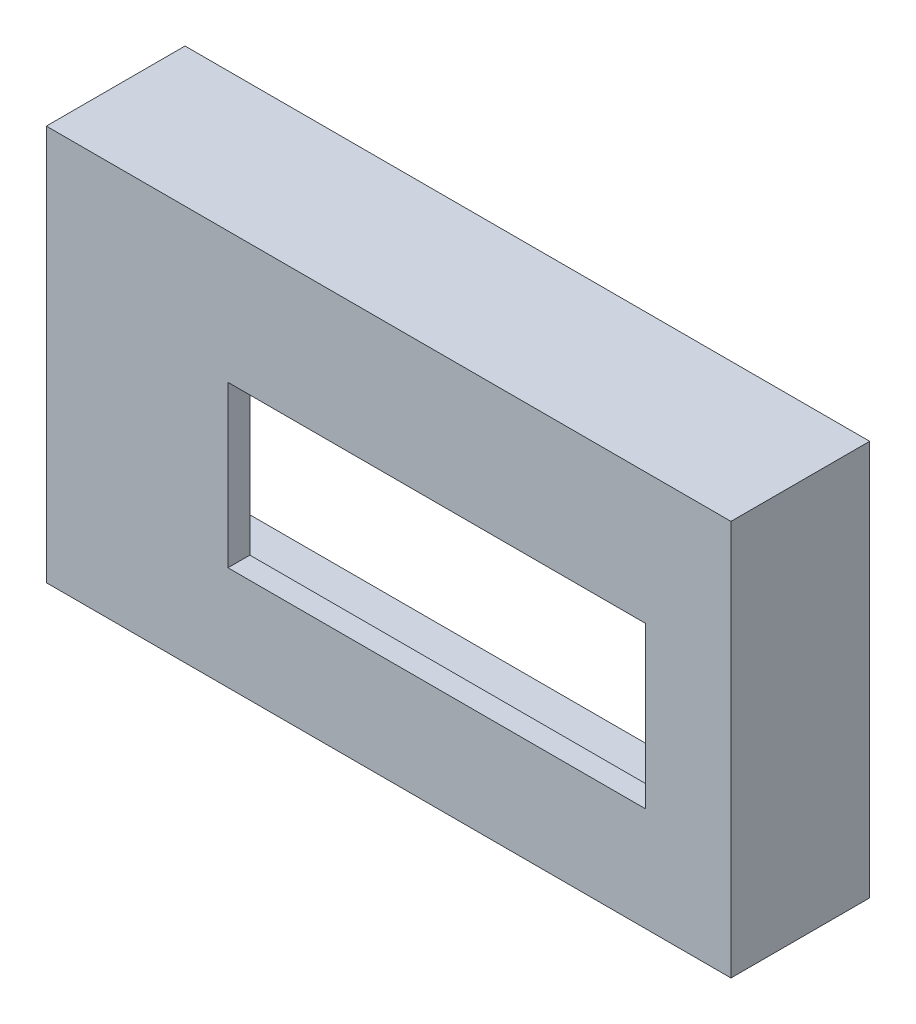
ISO-10303-21;
HEADER;
FILE_DESCRIPTION(('STEP AP214'),'2;1');
FILE_NAME('part.step','',(''),(''),'','','');
FILE_SCHEMA(('AUTOMOTIVE_DESIGN { 1 0 10303 214 1 1 1 1 }'));
ENDSEC;
DATA;
#1=APPLICATION_CONTEXT('core data for automotive mechanical design processes');
#2=APPLICATION_PROTOCOL_DEFINITION('international standard','automotive_design',2000,#1);
#3=PRODUCT_CONTEXT('',#1,'mechanical');
#4=PRODUCT('Part','Part','',(#3));
#5=PRODUCT_RELATED_PRODUCT_CATEGORY('part','',(#4));
#6=PRODUCT_DEFINITION_FORMATION('','',#4);
#7=PRODUCT_DEFINITION_CONTEXT('part definition',#1,'design');
#8=PRODUCT_DEFINITION('design','',#6,#7);
#9=PRODUCT_DEFINITION_SHAPE('','',#8);
#10=(LENGTH_UNIT() NAMED_UNIT(*) SI_UNIT(.MILLI.,.METRE.));
#11=(NAMED_UNIT(*) PLANE_ANGLE_UNIT() SI_UNIT($,.RADIAN.));
#12=(NAMED_UNIT(*) SI_UNIT($,.STERADIAN.) SOLID_ANGLE_UNIT());
#13=UNCERTAINTY_MEASURE_WITH_UNIT(LENGTH_MEASURE(1.E-05),#10,'distance_accuracy_value','');
#14=(GEOMETRIC_REPRESENTATION_CONTEXT(3) GLOBAL_UNCERTAINTY_ASSIGNED_CONTEXT((#13)) GLOBAL_UNIT_ASSIGNED_CONTEXT((#10,
#11,#12)) REPRESENTATION_CONTEXT('',''));
#15=CARTESIAN_POINT('',(0.,0.,0.));
#16=DIRECTION('',(0.,0.,1.));
#17=DIRECTION('',(1.,0.,0.));
#18=AXIS2_PLACEMENT_3D('',#15,#16,#17);
#19=CARTESIAN_POINT('',(0.,0.,0.));
#20=DIRECTION('',(0.,0.,1.));
#21=DIRECTION('',(1.,0.,0.));
#22=AXIS2_PLACEMENT_3D('',#19,#20,#21);
#23=PLANE('',#22);
#24=DIRECTION('',(-1.,0.,0.));
#25=VECTOR('',#24,1.);
#26=CARTESIAN_POINT('',(76.708,31.496,0.));
#27=LINE('',#26,#25);
#28=CARTESIAN_POINT('',(76.708,31.496,0.));
#29=VERTEX_POINT('',#28);
#30=CARTESIAN_POINT('',(4.064,31.496,0.));
#31=VERTEX_POINT('',#30);
#32=EDGE_CURVE('E171',#29,#31,#27,.T.);
#33=ORIENTED_EDGE('',*,*,#32,.T.);
#34=DIRECTION('',(0.,-1.,0.));
#35=VECTOR('',#34,1.);
#36=CARTESIAN_POINT('',(4.064,31.496,0.));
#37=LINE('',#36,#35);
#38=CARTESIAN_POINT('',(4.064,3.556,0.));
#39=VERTEX_POINT('',#38);
#40=EDGE_CURVE('E185',#31,#39,#37,.T.);
#41=ORIENTED_EDGE('',*,*,#40,.T.);
#42=DIRECTION('',(1.,0.,0.));
#43=VECTOR('',#42,1.);
#44=CARTESIAN_POINT('',(4.064,3.556,0.));
#45=LINE('',#44,#43);
#46=CARTESIAN_POINT('',(76.708,3.556,0.));
#47=VERTEX_POINT('',#46);
#48=EDGE_CURVE('E188',#39,#47,#45,.T.);
#49=ORIENTED_EDGE('',*,*,#48,.T.);
#50=DIRECTION('',(0.,1.,0.));
#51=VECTOR('',#50,1.);
#52=CARTESIAN_POINT('',(76.708,3.556,0.));
#53=LINE('',#52,#51);
#54=EDGE_CURVE('E175',#47,#29,#53,.T.);
#55=ORIENTED_EDGE('',*,*,#54,.T.);
#56=EDGE_LOOP('',(#33,#41,#49,#55));
#57=FACE_BOUND('',#56,.T.);
#58=DIRECTION('',(-1.,0.,0.));
#59=VECTOR('',#58,1.);
#60=CARTESIAN_POINT('',(-23.7229749034747,50.4908432830178,0.));
#61=LINE('',#60,#59);
#62=CARTESIAN_POINT('',(87.7620343020093,50.4908432830178,0.));
#63=VERTEX_POINT('',#62);
#64=CARTESIAN_POINT('',(-23.7229749034747,50.4908432830178,0.));
#65=VERTEX_POINT('',#64);
#66=EDGE_CURVE('E48',#63,#65,#61,.T.);
#67=ORIENTED_EDGE('',*,*,#66,.F.);
#68=DIRECTION('',(0.,1.,0.));
#69=VECTOR('',#68,1.);
#70=CARTESIAN_POINT('',(87.7620343020093,50.4908432830178,0.));
#71=LINE('',#70,#69);
#72=CARTESIAN_POINT('',(87.7620343020093,-10.6856321834333,0.));
#73=VERTEX_POINT('',#72);
#74=EDGE_CURVE('E53',#73,#63,#71,.T.);
#75=ORIENTED_EDGE('',*,*,#74,.F.);
#76=DIRECTION('',(1.,0.,0.));
#77=VECTOR('',#76,1.);
#78=CARTESIAN_POINT('',(-23.7229749034747,-10.6856321834333,0.));
#79=LINE('',#78,#77);
#80=CARTESIAN_POINT('',(-23.7229749034747,-10.6856321834333,0.));
#81=VERTEX_POINT('',#80);
#82=EDGE_CURVE('E144',#81,#73,#79,.T.);
#83=ORIENTED_EDGE('',*,*,#82,.F.);
#84=DIRECTION('',(0.,-1.,0.));
#85=VECTOR('',#84,1.);
#86=CARTESIAN_POINT('',(-23.7229749034747,50.4908432830178,0.));
#87=LINE('',#86,#85);
#88=EDGE_CURVE('E150',#65,#81,#87,.T.);
#89=ORIENTED_EDGE('',*,*,#88,.F.);
#90=EDGE_LOOP('',(#67,#75,#83,#89));
#91=FACE_BOUND('',#90,.T.);
#92=ADVANCED_FACE('F33',(#57,#91),#23,.F.);
#93=CARTESIAN_POINT('',(0.,0.,3.81));
#94=DIRECTION('',(0.,0.,1.));
#95=DIRECTION('',(1.,0.,0.));
#96=AXIS2_PLACEMENT_3D('',#93,#94,#95);
#97=PLANE('',#96);
#98=DIRECTION('',(0.,1.,0.));
#99=VECTOR('',#98,1.);
#100=CARTESIAN_POINT('',(91.5720343020093,-14.4956321834333,3.81));
#101=LINE('',#100,#99);
#102=CARTESIAN_POINT('',(91.5720343020093,-14.4956321834333,3.81));
#103=VERTEX_POINT('',#102);
#104=CARTESIAN_POINT('',(91.5720343020093,54.3008432830178,3.81));
#105=VERTEX_POINT('',#104);
#106=EDGE_CURVE('E202',#103,#105,#101,.T.);
#107=ORIENTED_EDGE('',*,*,#106,.T.);
#108=DIRECTION('',(-1.,0.,0.));
#109=VECTOR('',#108,1.);
#110=CARTESIAN_POINT('',(91.5720343020093,54.3008432830178,3.81));
#111=LINE('',#110,#109);
#112=CARTESIAN_POINT('',(-27.5329749034747,54.3008432830178,3.81));
#113=VERTEX_POINT('',#112);
#114=EDGE_CURVE('E205',#105,#113,#111,.T.);
#115=ORIENTED_EDGE('',*,*,#114,.T.);
#116=DIRECTION('',(0.,-1.,0.));
#117=VECTOR('',#116,1.);
#118=CARTESIAN_POINT('',(-27.5329749034747,-14.4956321834333,3.81));
#119=LINE('',#118,#117);
#120=CARTESIAN_POINT('',(-27.5329749034747,-14.4956321834333,3.81));
#121=VERTEX_POINT('',#120);
#122=EDGE_CURVE('E207',#113,#121,#119,.T.);
#123=ORIENTED_EDGE('',*,*,#122,.T.);
#124=DIRECTION('',(1.,0.,0.));
#125=VECTOR('',#124,1.);
#126=CARTESIAN_POINT('',(91.5720343020093,-14.4956321834333,3.81));
#127=LINE('',#126,#125);
#128=EDGE_CURVE('E209',#121,#103,#127,.T.);
#129=ORIENTED_EDGE('',*,*,#128,.T.);
#130=EDGE_LOOP('',(#107,#115,#123,#129));
#131=FACE_BOUND('',#130,.T.);
#132=DIRECTION('',(0.,-1.,0.));
#133=VECTOR('',#132,1.);
#134=CARTESIAN_POINT('',(4.064,31.496,3.81));
#135=LINE('',#134,#133);
#136=CARTESIAN_POINT('',(4.064,31.496,3.81));
#137=VERTEX_POINT('',#136);
#138=CARTESIAN_POINT('',(4.064,3.556,3.81));
#139=VERTEX_POINT('',#138);
#140=EDGE_CURVE('E174',#137,#139,#135,.T.);
#141=ORIENTED_EDGE('',*,*,#140,.F.);
#142=DIRECTION('',(-1.,0.,0.));
#143=VECTOR('',#142,1.);
#144=CARTESIAN_POINT('',(76.708,31.496,3.81));
#145=LINE('',#144,#143);
#146=CARTESIAN_POINT('',(76.708,31.496,3.81));
#147=VERTEX_POINT('',#146);
#148=EDGE_CURVE('E172',#147,#137,#145,.T.);
#149=ORIENTED_EDGE('',*,*,#148,.F.);
#150=DIRECTION('',(0.,1.,0.));
#151=VECTOR('',#150,1.);
#152=CARTESIAN_POINT('',(76.708,3.556,3.81));
#153=LINE('',#152,#151);
#154=CARTESIAN_POINT('',(76.708,3.556,3.81));
#155=VERTEX_POINT('',#154);
#156=EDGE_CURVE('E180',#155,#147,#153,.T.);
#157=ORIENTED_EDGE('',*,*,#156,.F.);
#158=DIRECTION('',(1.,0.,0.));
#159=VECTOR('',#158,1.);
#160=CARTESIAN_POINT('',(4.064,3.556,3.81));
#161=LINE('',#160,#159);
#162=EDGE_CURVE('E177',#139,#155,#161,.T.);
#163=ORIENTED_EDGE('',*,*,#162,.F.);
#164=EDGE_LOOP('',(#141,#149,#157,#163));
#165=FACE_BOUND('',#164,.T.);
#166=ADVANCED_FACE('F233',(#131,#165),#97,.T.);
#167=CARTESIAN_POINT('',(91.5720343020093,-14.4956321834333,3.81));
#168=DIRECTION('',(-1.,0.,0.));
#169=DIRECTION('',(0.,0.,1.));
#170=AXIS2_PLACEMENT_3D('',#167,#168,#169);
#171=PLANE('',#170);
#172=DIRECTION('',(0.,0.,-1.));
#173=VECTOR('',#172,1.);
#174=CARTESIAN_POINT('',(91.5720343020093,-14.4956321834333,3.81));
#175=LINE('',#174,#173);
#176=CARTESIAN_POINT('',(91.5720343020093,-14.4956321834333,-20.32));
#177=VERTEX_POINT('',#176);
#178=EDGE_CURVE('E211',#103,#177,#175,.T.);
#179=ORIENTED_EDGE('',*,*,#178,.T.);
#180=DIRECTION('',(0.,1.,0.));
#181=VECTOR('',#180,1.);
#182=CARTESIAN_POINT('',(91.5720343020093,54.3008432830178,-20.32));
#183=LINE('',#182,#181);
#184=CARTESIAN_POINT('',(91.5720343020093,54.3008432830178,-20.32));
#185=VERTEX_POINT('',#184);
#186=EDGE_CURVE('E165',#177,#185,#183,.T.);
#187=ORIENTED_EDGE('',*,*,#186,.T.);
#188=DIRECTION('',(0.,0.,-1.));
#189=VECTOR('',#188,1.);
#190=CARTESIAN_POINT('',(91.5720343020093,54.3008432830178,3.81));
#191=LINE('',#190,#189);
#192=EDGE_CURVE('E11',#105,#185,#191,.T.);
#193=ORIENTED_EDGE('',*,*,#192,.F.);
#194=ORIENTED_EDGE('',*,*,#106,.F.);
#195=EDGE_LOOP('',(#179,#187,#193,#194));
#196=FACE_BOUND('',#195,.T.);
#197=ADVANCED_FACE('F35',(#196),#171,.F.);
#198=CARTESIAN_POINT('',(91.5720343020093,54.3008432830178,3.81));
#199=DIRECTION('',(0.,-1.,0.));
#200=DIRECTION('',(0.,0.,-1.));
#201=AXIS2_PLACEMENT_3D('',#198,#199,#200);
#202=PLANE('',#201);
#203=ORIENTED_EDGE('',*,*,#192,.T.);
#204=DIRECTION('',(-1.,0.,0.));
#205=VECTOR('',#204,1.);
#206=CARTESIAN_POINT('',(-27.5329749034747,54.3008432830178,-20.32));
#207=LINE('',#206,#205);
#208=CARTESIAN_POINT('',(-27.5329749034747,54.3008432830178,-20.32));
#209=VERTEX_POINT('',#208);
#210=EDGE_CURVE('E168',#185,#209,#207,.T.);
#211=ORIENTED_EDGE('',*,*,#210,.T.);
#212=DIRECTION('',(0.,0.,-1.));
#213=VECTOR('',#212,1.);
#214=CARTESIAN_POINT('',(-27.5329749034747,54.3008432830178,3.81));
#215=LINE('',#214,#213);
#216=EDGE_CURVE('E41',#113,#209,#215,.T.);
#217=ORIENTED_EDGE('',*,*,#216,.F.);
#218=ORIENTED_EDGE('',*,*,#114,.F.);
#219=EDGE_LOOP('',(#203,#211,#217,#218));
#220=FACE_BOUND('',#219,.T.);
#221=ADVANCED_FACE('F224',(#220),#202,.F.);
#222=CARTESIAN_POINT('',(-27.5329749034747,-14.4956321834333,3.81));
#223=DIRECTION('',(1.,0.,0.));
#224=DIRECTION('',(0.,0.,-1.));
#225=AXIS2_PLACEMENT_3D('',#222,#223,#224);
#226=PLANE('',#225);
#227=ORIENTED_EDGE('',*,*,#216,.T.);
#228=DIRECTION('',(0.,-1.,0.));
#229=VECTOR('',#228,1.);
#230=CARTESIAN_POINT('',(-27.5329749034747,54.3008432830178,-20.32));
#231=LINE('',#230,#229);
#232=CARTESIAN_POINT('',(-27.5329749034747,-14.4956321834333,-20.32));
#233=VERTEX_POINT('',#232);
#234=EDGE_CURVE('E156',#209,#233,#231,.T.);
#235=ORIENTED_EDGE('',*,*,#234,.T.);
#236=DIRECTION('',(0.,0.,-1.));
#237=VECTOR('',#236,1.);
#238=CARTESIAN_POINT('',(-27.5329749034747,-14.4956321834333,3.81));
#239=LINE('',#238,#237);
#240=EDGE_CURVE('E213',#121,#233,#239,.T.);
#241=ORIENTED_EDGE('',*,*,#240,.F.);
#242=ORIENTED_EDGE('',*,*,#122,.F.);
#243=EDGE_LOOP('',(#227,#235,#241,#242));
#244=FACE_BOUND('',#243,.T.);
#245=ADVANCED_FACE('F218',(#244),#226,.F.);
#246=CARTESIAN_POINT('',(91.5720343020093,-14.4956321834333,3.81));
#247=DIRECTION('',(0.,1.,0.));
#248=DIRECTION('',(-1.,0.,0.));
#249=AXIS2_PLACEMENT_3D('',#246,#247,#248);
#250=PLANE('',#249);
#251=ORIENTED_EDGE('',*,*,#240,.T.);
#252=DIRECTION('',(1.,0.,0.));
#253=VECTOR('',#252,1.);
#254=CARTESIAN_POINT('',(-27.5329749034747,-14.4956321834333,-20.32));
#255=LINE('',#254,#253);
#256=EDGE_CURVE('E162',#233,#177,#255,.T.);
#257=ORIENTED_EDGE('',*,*,#256,.T.);
#258=ORIENTED_EDGE('',*,*,#178,.F.);
#259=ORIENTED_EDGE('',*,*,#128,.F.);
#260=EDGE_LOOP('',(#251,#257,#258,#259));
#261=FACE_BOUND('',#260,.T.);
#262=ADVANCED_FACE('F230',(#261),#250,.F.);
#263=CARTESIAN_POINT('',(76.708,31.496,3.81));
#264=DIRECTION('',(0.,-1.,0.));
#265=DIRECTION('',(0.,0.,-1.));
#266=AXIS2_PLACEMENT_3D('',#263,#264,#265);
#267=PLANE('',#266);
#268=ORIENTED_EDGE('',*,*,#32,.F.);
#269=DIRECTION('',(0.,0.,-1.));
#270=VECTOR('',#269,1.);
#271=CARTESIAN_POINT('',(76.708,31.496,3.81));
#272=LINE('',#271,#270);
#273=EDGE_CURVE('E182',#147,#29,#272,.T.);
#274=ORIENTED_EDGE('',*,*,#273,.F.);
#275=ORIENTED_EDGE('',*,*,#148,.T.);
#276=DIRECTION('',(0.,0.,-1.));
#277=VECTOR('',#276,1.);
#278=CARTESIAN_POINT('',(4.064,31.496,3.81));
#279=LINE('',#278,#277);
#280=EDGE_CURVE('E199',#137,#31,#279,.T.);
#281=ORIENTED_EDGE('',*,*,#280,.T.);
#282=EDGE_LOOP('',(#268,#274,#275,#281));
#283=FACE_BOUND('',#282,.T.);
#284=ADVANCED_FACE('F251',(#283),#267,.T.);
#285=CARTESIAN_POINT('',(4.064,31.496,3.81));
#286=DIRECTION('',(1.,0.,0.));
#287=DIRECTION('',(0.,0.,-1.));
#288=AXIS2_PLACEMENT_3D('',#285,#286,#287);
#289=PLANE('',#288);
#290=ORIENTED_EDGE('',*,*,#40,.F.);
#291=ORIENTED_EDGE('',*,*,#280,.F.);
#292=ORIENTED_EDGE('',*,*,#140,.T.);
#293=DIRECTION('',(0.,0.,-1.));
#294=VECTOR('',#293,1.);
#295=CARTESIAN_POINT('',(4.064,3.556,3.81));
#296=LINE('',#295,#294);
#297=EDGE_CURVE('E197',#139,#39,#296,.T.);
#298=ORIENTED_EDGE('',*,*,#297,.T.);
#299=EDGE_LOOP('',(#290,#291,#292,#298));
#300=FACE_BOUND('',#299,.T.);
#301=ADVANCED_FACE('F244',(#300),#289,.T.);
#302=CARTESIAN_POINT('',(4.064,3.556,3.81));
#303=DIRECTION('',(0.,1.,0.));
#304=DIRECTION('',(0.,0.,1.));
#305=AXIS2_PLACEMENT_3D('',#302,#303,#304);
#306=PLANE('',#305);
#307=ORIENTED_EDGE('',*,*,#48,.F.);
#308=ORIENTED_EDGE('',*,*,#297,.F.);
#309=ORIENTED_EDGE('',*,*,#162,.T.);
#310=DIRECTION('',(0.,0.,-1.));
#311=VECTOR('',#310,1.);
#312=CARTESIAN_POINT('',(76.708,3.556,3.81));
#313=LINE('',#312,#311);
#314=EDGE_CURVE('E195',#155,#47,#313,.T.);
#315=ORIENTED_EDGE('',*,*,#314,.T.);
#316=EDGE_LOOP('',(#307,#308,#309,#315));
#317=FACE_BOUND('',#316,.T.);
#318=ADVANCED_FACE('F247',(#317),#306,.T.);
#319=CARTESIAN_POINT('',(76.708,3.556,3.81));
#320=DIRECTION('',(-1.,0.,0.));
#321=DIRECTION('',(0.,0.,1.));
#322=AXIS2_PLACEMENT_3D('',#319,#320,#321);
#323=PLANE('',#322);
#324=ORIENTED_EDGE('',*,*,#54,.F.);
#325=ORIENTED_EDGE('',*,*,#314,.F.);
#326=ORIENTED_EDGE('',*,*,#156,.T.);
#327=ORIENTED_EDGE('',*,*,#273,.T.);
#328=EDGE_LOOP('',(#324,#325,#326,#327));
#329=FACE_BOUND('',#328,.T.);
#330=ADVANCED_FACE('F254',(#329),#323,.T.);
#331=CARTESIAN_POINT('',(0.,0.,-20.32));
#332=DIRECTION('',(0.,0.,1.));
#333=DIRECTION('',(1.,0.,0.));
#334=AXIS2_PLACEMENT_3D('',#331,#332,#333);
#335=PLANE('',#334);
#336=DIRECTION('',(0.,1.,0.));
#337=VECTOR('',#336,1.);
#338=CARTESIAN_POINT('',(87.7620343020093,50.4908432830178,-20.32));
#339=LINE('',#338,#337);
#340=CARTESIAN_POINT('',(87.7620343020093,-10.6856321834333,-20.32));
#341=VERTEX_POINT('',#340);
#342=CARTESIAN_POINT('',(87.7620343020093,50.4908432830178,-20.32));
#343=VERTEX_POINT('',#342);
#344=EDGE_CURVE('E129',#341,#343,#339,.T.);
#345=ORIENTED_EDGE('',*,*,#344,.T.);
#346=DIRECTION('',(-1.,0.,0.));
#347=VECTOR('',#346,1.);
#348=CARTESIAN_POINT('',(-23.7229749034747,50.4908432830178,-20.32));
#349=LINE('',#348,#347);
#350=CARTESIAN_POINT('',(-23.7229749034747,50.4908432830178,-20.32));
#351=VERTEX_POINT('',#350);
#352=EDGE_CURVE('E124',#343,#351,#349,.T.);
#353=ORIENTED_EDGE('',*,*,#352,.T.);
#354=DIRECTION('',(0.,-1.,0.));
#355=VECTOR('',#354,1.);
#356=CARTESIAN_POINT('',(-23.7229749034747,50.4908432830178,-20.32));
#357=LINE('',#356,#355);
#358=CARTESIAN_POINT('',(-23.7229749034747,-10.6856321834333,-20.32));
#359=VERTEX_POINT('',#358);
#360=EDGE_CURVE('E133',#351,#359,#357,.T.);
#361=ORIENTED_EDGE('',*,*,#360,.T.);
#362=DIRECTION('',(1.,0.,0.));
#363=VECTOR('',#362,1.);
#364=CARTESIAN_POINT('',(-23.7229749034747,-10.6856321834333,-20.32));
#365=LINE('',#364,#363);
#366=EDGE_CURVE('E138',#359,#341,#365,.T.);
#367=ORIENTED_EDGE('',*,*,#366,.T.);
#368=EDGE_LOOP('',(#345,#353,#361,#367));
#369=FACE_BOUND('',#368,.T.);
#370=ORIENTED_EDGE('',*,*,#234,.F.);
#371=ORIENTED_EDGE('',*,*,#210,.F.);
#372=ORIENTED_EDGE('',*,*,#186,.F.);
#373=ORIENTED_EDGE('',*,*,#256,.F.);
#374=EDGE_LOOP('',(#370,#371,#372,#373));
#375=FACE_BOUND('',#374,.T.);
#376=ADVANCED_FACE('F140',(#369,#375),#335,.F.);
#377=CARTESIAN_POINT('',(-23.7229749034747,50.4908432830178,-20.32));
#378=DIRECTION('',(0.,1.,0.));
#379=DIRECTION('',(0.,0.,1.));
#380=AXIS2_PLACEMENT_3D('',#377,#378,#379);
#381=PLANE('',#380);
#382=ORIENTED_EDGE('',*,*,#66,.T.);
#383=DIRECTION('',(0.,0.,1.));
#384=VECTOR('',#383,1.);
#385=CARTESIAN_POINT('',(-23.7229749034747,50.4908432830178,-20.32));
#386=LINE('',#385,#384);
#387=EDGE_CURVE('E120',#351,#65,#386,.T.);
#388=ORIENTED_EDGE('',*,*,#387,.F.);
#389=ORIENTED_EDGE('',*,*,#352,.F.);
#390=DIRECTION('',(0.,0.,1.));
#391=VECTOR('',#390,1.);
#392=CARTESIAN_POINT('',(87.7620343020093,50.4908432830178,-20.32));
#393=LINE('',#392,#391);
#394=EDGE_CURVE('E154',#343,#63,#393,.T.);
#395=ORIENTED_EDGE('',*,*,#394,.T.);
#396=EDGE_LOOP('',(#382,#388,#389,#395));
#397=FACE_BOUND('',#396,.T.);
#398=ADVANCED_FACE('F122',(#397),#381,.F.);
#399=CARTESIAN_POINT('',(87.7620343020093,50.4908432830178,-20.32));
#400=DIRECTION('',(1.,0.,0.));
#401=DIRECTION('',(0.,0.,-1.));
#402=AXIS2_PLACEMENT_3D('',#399,#400,#401);
#403=PLANE('',#402);
#404=ORIENTED_EDGE('',*,*,#74,.T.);
#405=ORIENTED_EDGE('',*,*,#394,.F.);
#406=ORIENTED_EDGE('',*,*,#344,.F.);
#407=DIRECTION('',(0.,0.,1.));
#408=VECTOR('',#407,1.);
#409=CARTESIAN_POINT('',(87.7620343020093,-10.6856321834333,-20.32));
#410=LINE('',#409,#408);
#411=EDGE_CURVE('E157',#341,#73,#410,.T.);
#412=ORIENTED_EDGE('',*,*,#411,.T.);
#413=EDGE_LOOP('',(#404,#405,#406,#412));
#414=FACE_BOUND('',#413,.T.);
#415=ADVANCED_FACE('F329',(#414),#403,.F.);
#416=CARTESIAN_POINT('',(-23.7229749034747,-10.6856321834333,-20.32));
#417=DIRECTION('',(0.,-1.,0.));
#418=DIRECTION('',(0.,0.,-1.));
#419=AXIS2_PLACEMENT_3D('',#416,#417,#418);
#420=PLANE('',#419);
#421=ORIENTED_EDGE('',*,*,#82,.T.);
#422=ORIENTED_EDGE('',*,*,#411,.F.);
#423=ORIENTED_EDGE('',*,*,#366,.F.);
#424=DIRECTION('',(0.,0.,1.));
#425=VECTOR('',#424,1.);
#426=CARTESIAN_POINT('',(-23.7229749034747,-10.6856321834333,-20.32));
#427=LINE('',#426,#425);
#428=EDGE_CURVE('E128',#359,#81,#427,.T.);
#429=ORIENTED_EDGE('',*,*,#428,.T.);
#430=EDGE_LOOP('',(#421,#422,#423,#429));
#431=FACE_BOUND('',#430,.T.);
#432=ADVANCED_FACE('F337',(#431),#420,.F.);
#433=CARTESIAN_POINT('',(-23.7229749034747,50.4908432830178,-20.32));
#434=DIRECTION('',(-1.,0.,0.));
#435=DIRECTION('',(0.,0.,1.));
#436=AXIS2_PLACEMENT_3D('',#433,#434,#435);
#437=PLANE('',#436);
#438=ORIENTED_EDGE('',*,*,#88,.T.);
#439=ORIENTED_EDGE('',*,*,#428,.F.);
#440=ORIENTED_EDGE('',*,*,#360,.F.);
#441=ORIENTED_EDGE('',*,*,#387,.T.);
#442=EDGE_LOOP('',(#438,#439,#440,#441));
#443=FACE_BOUND('',#442,.T.);
#444=ADVANCED_FACE('F134',(#443),#437,.F.);
#445=CLOSED_SHELL('',(#92,#166,#197,#221,#245,#262,#284,#301,#318,#330,#376,#398,#415,#432,#444));
#446=MANIFOLD_SOLID_BREP('B2',#445);
#447=ADVANCED_BREP_SHAPE_REPRESENTATION('',(#18,#446),#14);
#448=SHAPE_DEFINITION_REPRESENTATION(#9,#447);
ENDSEC;
END-ISO-10303-21;
